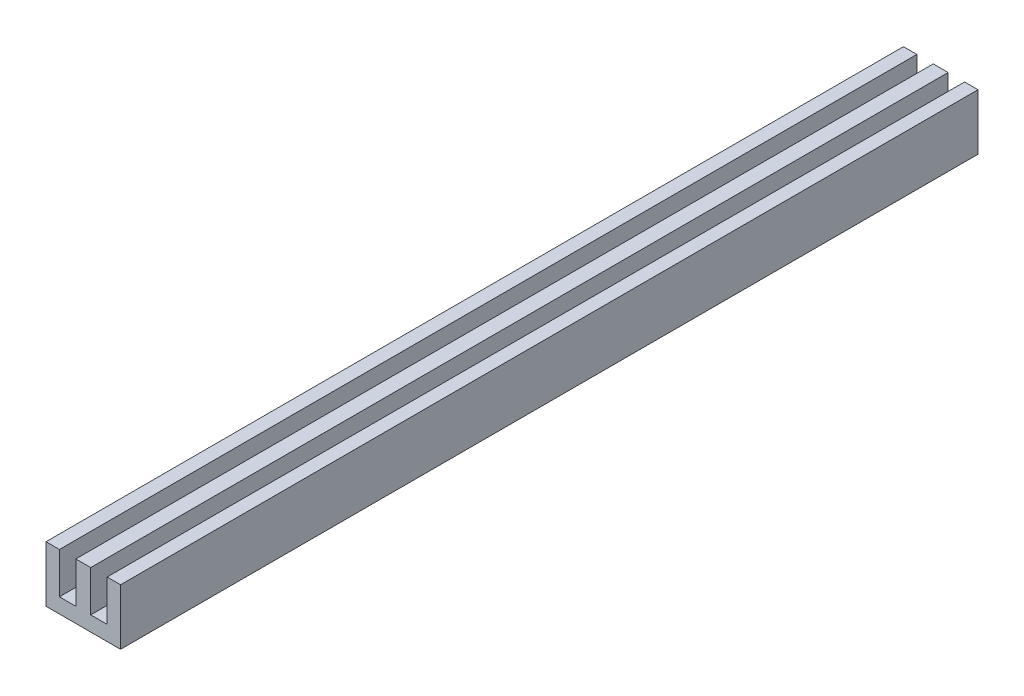
ISO-10303-21;
HEADER;
FILE_DESCRIPTION(('STEP AP214'),'2;1');
FILE_NAME('part.step','',(''),(''),'','','');
FILE_SCHEMA(('AUTOMOTIVE_DESIGN { 1 0 10303 214 1 1 1 1 }'));
ENDSEC;
DATA;
#1=APPLICATION_CONTEXT('core data for automotive mechanical design processes');
#2=APPLICATION_PROTOCOL_DEFINITION('international standard','automotive_design',2000,#1);
#3=PRODUCT_CONTEXT('',#1,'mechanical');
#4=PRODUCT('Part','Part','',(#3));
#5=PRODUCT_RELATED_PRODUCT_CATEGORY('part','',(#4));
#6=PRODUCT_DEFINITION_FORMATION('','',#4);
#7=PRODUCT_DEFINITION_CONTEXT('part definition',#1,'design');
#8=PRODUCT_DEFINITION('design','',#6,#7);
#9=PRODUCT_DEFINITION_SHAPE('','',#8);
#10=(LENGTH_UNIT() NAMED_UNIT(*) SI_UNIT(.MILLI.,.METRE.));
#11=(NAMED_UNIT(*) PLANE_ANGLE_UNIT() SI_UNIT($,.RADIAN.));
#12=(NAMED_UNIT(*) SI_UNIT($,.STERADIAN.) SOLID_ANGLE_UNIT());
#13=UNCERTAINTY_MEASURE_WITH_UNIT(LENGTH_MEASURE(1.E-05),#10,'distance_accuracy_value','');
#14=(GEOMETRIC_REPRESENTATION_CONTEXT(3) GLOBAL_UNCERTAINTY_ASSIGNED_CONTEXT((#13)) GLOBAL_UNIT_ASSIGNED_CONTEXT((#10,
#11,#12)) REPRESENTATION_CONTEXT('',''));
#15=CARTESIAN_POINT('',(0.,0.,0.));
#16=DIRECTION('',(0.,0.,1.));
#17=DIRECTION('',(1.,0.,0.));
#18=AXIS2_PLACEMENT_3D('',#15,#16,#17);
#19=CARTESIAN_POINT('',(0.,4.,115.));
#20=DIRECTION('',(0.,-1.,0.));
#21=DIRECTION('',(0.,0.,-1.));
#22=AXIS2_PLACEMENT_3D('',#19,#20,#21);
#23=PLANE('',#22);
#24=DIRECTION('',(-1.,0.,0.));
#25=VECTOR('',#24,1.);
#26=CARTESIAN_POINT('',(0.,4.,0.));
#27=LINE('',#26,#25);
#28=CARTESIAN_POINT('',(-3.,4.,0.));
#29=VERTEX_POINT('',#28);
#30=CARTESIAN_POINT('',(-5.,4.,0.));
#31=VERTEX_POINT('',#30);
#32=EDGE_CURVE('E159',#29,#31,#27,.T.);
#33=ORIENTED_EDGE('',*,*,#32,.T.);
#34=DIRECTION('',(0.,0.,-1.));
#35=VECTOR('',#34,1.);
#36=CARTESIAN_POINT('',(-5.,4.,115.));
#37=LINE('',#36,#35);
#38=CARTESIAN_POINT('',(-5.,4.,115.));
#39=VERTEX_POINT('',#38);
#40=EDGE_CURVE('E11',#39,#31,#37,.T.);
#41=ORIENTED_EDGE('',*,*,#40,.F.);
#42=DIRECTION('',(-1.,0.,0.));
#43=VECTOR('',#42,1.);
#44=CARTESIAN_POINT('',(0.,4.,115.));
#45=LINE('',#44,#43);
#46=CARTESIAN_POINT('',(-3.,4.,115.));
#47=VERTEX_POINT('',#46);
#48=EDGE_CURVE('E185',#47,#39,#45,.T.);
#49=ORIENTED_EDGE('',*,*,#48,.F.);
#50=DIRECTION('',(0.,0.,-1.));
#51=VECTOR('',#50,1.);
#52=CARTESIAN_POINT('',(-3.,4.,115.));
#53=LINE('',#52,#51);
#54=EDGE_CURVE('E51',#47,#29,#53,.T.);
#55=ORIENTED_EDGE('',*,*,#54,.T.);
#56=EDGE_LOOP('',(#33,#41,#49,#55));
#57=FACE_BOUND('',#56,.T.);
#58=ADVANCED_FACE('F35',(#57),#23,.F.);
#59=CARTESIAN_POINT('',(-5.,0.,115.));
#60=DIRECTION('',(1.,0.,0.));
#61=DIRECTION('',(0.,1.,0.));
#62=AXIS2_PLACEMENT_3D('',#59,#60,#61);
#63=PLANE('',#62);
#64=DIRECTION('',(0.,-1.,0.));
#65=VECTOR('',#64,1.);
#66=CARTESIAN_POINT('',(-5.,0.,0.));
#67=LINE('',#66,#65);
#68=CARTESIAN_POINT('',(-5.,-1.5,0.));
#69=VERTEX_POINT('',#68);
#70=EDGE_CURVE('E161',#31,#69,#67,.T.);
#71=ORIENTED_EDGE('',*,*,#70,.T.);
#72=DIRECTION('',(0.,0.,-1.));
#73=VECTOR('',#72,1.);
#74=CARTESIAN_POINT('',(-5.,-1.5,115.));
#75=LINE('',#74,#73);
#76=CARTESIAN_POINT('',(-5.,-1.5,115.));
#77=VERTEX_POINT('',#76);
#78=EDGE_CURVE('E43',#77,#69,#75,.T.);
#79=ORIENTED_EDGE('',*,*,#78,.F.);
#80=DIRECTION('',(0.,-1.,0.));
#81=VECTOR('',#80,1.);
#82=CARTESIAN_POINT('',(-5.,0.,115.));
#83=LINE('',#82,#81);
#84=EDGE_CURVE('E102',#39,#77,#83,.T.);
#85=ORIENTED_EDGE('',*,*,#84,.F.);
#86=ORIENTED_EDGE('',*,*,#40,.T.);
#87=EDGE_LOOP('',(#71,#79,#85,#86));
#88=FACE_BOUND('',#87,.T.);
#89=ADVANCED_FACE('F252',(#88),#63,.F.);
#90=CARTESIAN_POINT('',(0.,-1.5,115.));
#91=DIRECTION('',(0.,-1.,0.));
#92=DIRECTION('',(0.,0.,-1.));
#93=AXIS2_PLACEMENT_3D('',#90,#91,#92);
#94=PLANE('',#93);
#95=DIRECTION('',(-1.,0.,0.));
#96=VECTOR('',#95,1.);
#97=CARTESIAN_POINT('',(0.,-1.5,0.));
#98=LINE('',#97,#96);
#99=CARTESIAN_POINT('',(-7.2,-1.5,0.));
#100=VERTEX_POINT('',#99);
#101=EDGE_CURVE('E163',#69,#100,#98,.T.);
#102=ORIENTED_EDGE('',*,*,#101,.T.);
#103=DIRECTION('',(0.,0.,-1.));
#104=VECTOR('',#103,1.);
#105=CARTESIAN_POINT('',(-7.2,-1.5,115.));
#106=LINE('',#105,#104);
#107=CARTESIAN_POINT('',(-7.2,-1.5,115.));
#108=VERTEX_POINT('',#107);
#109=EDGE_CURVE('E202',#108,#100,#106,.T.);
#110=ORIENTED_EDGE('',*,*,#109,.F.);
#111=DIRECTION('',(-1.,0.,0.));
#112=VECTOR('',#111,1.);
#113=CARTESIAN_POINT('',(0.,-1.5,115.));
#114=LINE('',#113,#112);
#115=EDGE_CURVE('E147',#77,#108,#114,.T.);
#116=ORIENTED_EDGE('',*,*,#115,.F.);
#117=ORIENTED_EDGE('',*,*,#78,.T.);
#118=EDGE_LOOP('',(#102,#110,#116,#117));
#119=FACE_BOUND('',#118,.T.);
#120=ADVANCED_FACE('F208',(#119),#94,.F.);
#121=CARTESIAN_POINT('',(-7.2,0.,115.));
#122=DIRECTION('',(-1.,0.,0.));
#123=DIRECTION('',(0.,0.,1.));
#124=AXIS2_PLACEMENT_3D('',#121,#122,#123);
#125=PLANE('',#124);
#126=DIRECTION('',(0.,1.,0.));
#127=VECTOR('',#126,1.);
#128=CARTESIAN_POINT('',(-7.2,0.,0.));
#129=LINE('',#128,#127);
#130=CARTESIAN_POINT('',(-7.2,4.,0.));
#131=VERTEX_POINT('',#130);
#132=EDGE_CURVE('E165',#100,#131,#129,.T.);
#133=ORIENTED_EDGE('',*,*,#132,.T.);
#134=DIRECTION('',(0.,0.,-1.));
#135=VECTOR('',#134,1.);
#136=CARTESIAN_POINT('',(-7.2,4.,115.));
#137=LINE('',#136,#135);
#138=CARTESIAN_POINT('',(-7.2,4.,115.));
#139=VERTEX_POINT('',#138);
#140=EDGE_CURVE('E199',#139,#131,#137,.T.);
#141=ORIENTED_EDGE('',*,*,#140,.F.);
#142=DIRECTION('',(0.,1.,0.));
#143=VECTOR('',#142,1.);
#144=CARTESIAN_POINT('',(-7.2,0.,115.));
#145=LINE('',#144,#143);
#146=EDGE_CURVE('E226',#108,#139,#145,.T.);
#147=ORIENTED_EDGE('',*,*,#146,.F.);
#148=ORIENTED_EDGE('',*,*,#109,.T.);
#149=EDGE_LOOP('',(#133,#141,#147,#148));
#150=FACE_BOUND('',#149,.T.);
#151=ADVANCED_FACE('F217',(#150),#125,.F.);
#152=CARTESIAN_POINT('',(0.,4.,115.));
#153=DIRECTION('',(0.,-1.,0.));
#154=DIRECTION('',(0.,0.,-1.));
#155=AXIS2_PLACEMENT_3D('',#152,#153,#154);
#156=PLANE('',#155);
#157=DIRECTION('',(-1.,0.,0.));
#158=VECTOR('',#157,1.);
#159=CARTESIAN_POINT('',(0.,4.,0.));
#160=LINE('',#159,#158);
#161=CARTESIAN_POINT('',(-9.,4.,0.));
#162=VERTEX_POINT('',#161);
#163=EDGE_CURVE('E168',#131,#162,#160,.T.);
#164=ORIENTED_EDGE('',*,*,#163,.T.);
#165=DIRECTION('',(0.,0.,-1.));
#166=VECTOR('',#165,1.);
#167=CARTESIAN_POINT('',(-9.,4.,115.));
#168=LINE('',#167,#166);
#169=CARTESIAN_POINT('',(-9.,4.,115.));
#170=VERTEX_POINT('',#169);
#171=EDGE_CURVE('E196',#170,#162,#168,.T.);
#172=ORIENTED_EDGE('',*,*,#171,.F.);
#173=DIRECTION('',(-1.,0.,0.));
#174=VECTOR('',#173,1.);
#175=CARTESIAN_POINT('',(0.,4.,115.));
#176=LINE('',#175,#174);
#177=EDGE_CURVE('E223',#139,#170,#176,.T.);
#178=ORIENTED_EDGE('',*,*,#177,.F.);
#179=ORIENTED_EDGE('',*,*,#140,.T.);
#180=EDGE_LOOP('',(#164,#172,#178,#179));
#181=FACE_BOUND('',#180,.T.);
#182=ADVANCED_FACE('F221',(#181),#156,.F.);
#183=CARTESIAN_POINT('',(-9.,0.,115.));
#184=DIRECTION('',(1.,0.,0.));
#185=DIRECTION('',(0.,1.,0.));
#186=AXIS2_PLACEMENT_3D('',#183,#184,#185);
#187=PLANE('',#186);
#188=DIRECTION('',(0.,-1.,0.));
#189=VECTOR('',#188,1.);
#190=CARTESIAN_POINT('',(-9.,0.,0.));
#191=LINE('',#190,#189);
#192=CARTESIAN_POINT('',(-9.,-3.5,0.));
#193=VERTEX_POINT('',#192);
#194=EDGE_CURVE('E170',#162,#193,#191,.T.);
#195=ORIENTED_EDGE('',*,*,#194,.T.);
#196=DIRECTION('',(0.,0.,-1.));
#197=VECTOR('',#196,1.);
#198=CARTESIAN_POINT('',(-9.,-3.5,115.));
#199=LINE('',#198,#197);
#200=CARTESIAN_POINT('',(-9.,-3.5,115.));
#201=VERTEX_POINT('',#200);
#202=EDGE_CURVE('E193',#201,#193,#199,.T.);
#203=ORIENTED_EDGE('',*,*,#202,.F.);
#204=DIRECTION('',(0.,-1.,0.));
#205=VECTOR('',#204,1.);
#206=CARTESIAN_POINT('',(-9.,0.,115.));
#207=LINE('',#206,#205);
#208=EDGE_CURVE('E225',#170,#201,#207,.T.);
#209=ORIENTED_EDGE('',*,*,#208,.F.);
#210=ORIENTED_EDGE('',*,*,#171,.T.);
#211=EDGE_LOOP('',(#195,#203,#209,#210));
#212=FACE_BOUND('',#211,.T.);
#213=ADVANCED_FACE('F267',(#212),#187,.F.);
#214=CARTESIAN_POINT('',(0.,-3.5,115.));
#215=DIRECTION('',(0.,1.,0.));
#216=DIRECTION('',(0.,0.,1.));
#217=AXIS2_PLACEMENT_3D('',#214,#215,#216);
#218=PLANE('',#217);
#219=DIRECTION('',(1.,0.,0.));
#220=VECTOR('',#219,1.);
#221=CARTESIAN_POINT('',(0.,-3.5,0.));
#222=LINE('',#221,#220);
#223=CARTESIAN_POINT('',(0.999999999999999,-3.5,0.));
#224=VERTEX_POINT('',#223);
#225=EDGE_CURVE('E172',#193,#224,#222,.T.);
#226=ORIENTED_EDGE('',*,*,#225,.T.);
#227=DIRECTION('',(0.,0.,-1.));
#228=VECTOR('',#227,1.);
#229=CARTESIAN_POINT('',(0.999999999999999,-3.5,115.));
#230=LINE('',#229,#228);
#231=CARTESIAN_POINT('',(0.999999999999999,-3.5,115.));
#232=VERTEX_POINT('',#231);
#233=EDGE_CURVE('E191',#232,#224,#230,.T.);
#234=ORIENTED_EDGE('',*,*,#233,.F.);
#235=DIRECTION('',(1.,0.,0.));
#236=VECTOR('',#235,1.);
#237=CARTESIAN_POINT('',(0.,-3.5,115.));
#238=LINE('',#237,#236);
#239=EDGE_CURVE('E228',#201,#232,#238,.T.);
#240=ORIENTED_EDGE('',*,*,#239,.F.);
#241=ORIENTED_EDGE('',*,*,#202,.T.);
#242=EDGE_LOOP('',(#226,#234,#240,#241));
#243=FACE_BOUND('',#242,.T.);
#244=ADVANCED_FACE('F270',(#243),#218,.F.);
#245=CARTESIAN_POINT('',(0.999999999999999,0.,115.));
#246=DIRECTION('',(1.,0.,0.));
#247=DIRECTION('',(0.,0.,-1.));
#248=AXIS2_PLACEMENT_3D('',#245,#246,#247);
#249=PLANE('',#248);
#250=DIRECTION('',(0.,-1.,0.));
#251=VECTOR('',#250,1.);
#252=CARTESIAN_POINT('',(0.999999999999999,0.,0.));
#253=LINE('',#252,#251);
#254=CARTESIAN_POINT('',(0.999999999999999,4.,0.));
#255=VERTEX_POINT('',#254);
#256=EDGE_CURVE('E175',#255,#224,#253,.T.);
#257=ORIENTED_EDGE('',*,*,#256,.F.);
#258=DIRECTION('',(0.,0.,-1.));
#259=VECTOR('',#258,1.);
#260=CARTESIAN_POINT('',(0.999999999999999,4.,115.));
#261=LINE('',#260,#259);
#262=CARTESIAN_POINT('',(0.999999999999999,4.,115.));
#263=VERTEX_POINT('',#262);
#264=EDGE_CURVE('E189',#263,#255,#261,.T.);
#265=ORIENTED_EDGE('',*,*,#264,.F.);
#266=DIRECTION('',(0.,-1.,0.));
#267=VECTOR('',#266,1.);
#268=CARTESIAN_POINT('',(0.999999999999999,0.,115.));
#269=LINE('',#268,#267);
#270=EDGE_CURVE('E154',#263,#232,#269,.T.);
#271=ORIENTED_EDGE('',*,*,#270,.T.);
#272=ORIENTED_EDGE('',*,*,#233,.T.);
#273=EDGE_LOOP('',(#257,#265,#271,#272));
#274=FACE_BOUND('',#273,.T.);
#275=ADVANCED_FACE('F235',(#274),#249,.T.);
#276=CARTESIAN_POINT('',(0.,4.,115.));
#277=DIRECTION('',(0.,1.,0.));
#278=DIRECTION('',(0.,0.,1.));
#279=AXIS2_PLACEMENT_3D('',#276,#277,#278);
#280=PLANE('',#279);
#281=DIRECTION('',(1.,0.,0.));
#282=VECTOR('',#281,1.);
#283=CARTESIAN_POINT('',(0.,4.,0.));
#284=LINE('',#283,#282);
#285=CARTESIAN_POINT('',(-0.799999999999997,4.,0.));
#286=VERTEX_POINT('',#285);
#287=EDGE_CURVE('E178',#286,#255,#284,.T.);
#288=ORIENTED_EDGE('',*,*,#287,.F.);
#289=DIRECTION('',(0.,0.,-1.));
#290=VECTOR('',#289,1.);
#291=CARTESIAN_POINT('',(-0.799999999999997,4.,115.));
#292=LINE('',#291,#290);
#293=CARTESIAN_POINT('',(-0.799999999999997,4.,115.));
#294=VERTEX_POINT('',#293);
#295=EDGE_CURVE('E139',#294,#286,#292,.T.);
#296=ORIENTED_EDGE('',*,*,#295,.F.);
#297=DIRECTION('',(1.,0.,0.));
#298=VECTOR('',#297,1.);
#299=CARTESIAN_POINT('',(0.,4.,115.));
#300=LINE('',#299,#298);
#301=EDGE_CURVE('E152',#294,#263,#300,.T.);
#302=ORIENTED_EDGE('',*,*,#301,.T.);
#303=ORIENTED_EDGE('',*,*,#264,.T.);
#304=EDGE_LOOP('',(#288,#296,#302,#303));
#305=FACE_BOUND('',#304,.T.);
#306=ADVANCED_FACE('F240',(#305),#280,.T.);
#307=CARTESIAN_POINT('',(-0.799999999999998,0.,115.));
#308=DIRECTION('',(-1.,0.,0.));
#309=DIRECTION('',(0.,-1.,0.));
#310=AXIS2_PLACEMENT_3D('',#307,#308,#309);
#311=PLANE('',#310);
#312=DIRECTION('',(0.,1.,0.));
#313=VECTOR('',#312,1.);
#314=CARTESIAN_POINT('',(-0.799999999999998,0.,0.));
#315=LINE('',#314,#313);
#316=CARTESIAN_POINT('',(-0.799999999999999,-1.5,0.));
#317=VERTEX_POINT('',#316);
#318=EDGE_CURVE('E136',#317,#286,#315,.T.);
#319=ORIENTED_EDGE('',*,*,#318,.F.);
#320=DIRECTION('',(0.,0.,-1.));
#321=VECTOR('',#320,1.);
#322=CARTESIAN_POINT('',(-0.799999999999999,-1.5,115.));
#323=LINE('',#322,#321);
#324=CARTESIAN_POINT('',(-0.799999999999999,-1.5,115.));
#325=VERTEX_POINT('',#324);
#326=EDGE_CURVE('E130',#325,#317,#323,.T.);
#327=ORIENTED_EDGE('',*,*,#326,.F.);
#328=DIRECTION('',(0.,1.,0.));
#329=VECTOR('',#328,1.);
#330=CARTESIAN_POINT('',(-0.799999999999998,0.,115.));
#331=LINE('',#330,#329);
#332=EDGE_CURVE('E134',#325,#294,#331,.T.);
#333=ORIENTED_EDGE('',*,*,#332,.T.);
#334=ORIENTED_EDGE('',*,*,#295,.T.);
#335=EDGE_LOOP('',(#319,#327,#333,#334));
#336=FACE_BOUND('',#335,.T.);
#337=ADVANCED_FACE('F132',(#336),#311,.T.);
#338=CARTESIAN_POINT('',(-3.,-1.5,0.));
#339=VERTEX_POINT('',#338);
#340=EDGE_CURVE('E166',#317,#339,#98,.T.);
#341=ORIENTED_EDGE('',*,*,#340,.T.);
#342=DIRECTION('',(0.,0.,-1.));
#343=VECTOR('',#342,1.);
#344=CARTESIAN_POINT('',(-3.,-1.5,115.));
#345=LINE('',#344,#343);
#346=CARTESIAN_POINT('',(-3.,-1.5,115.));
#347=VERTEX_POINT('',#346);
#348=EDGE_CURVE('E90',#347,#339,#345,.T.);
#349=ORIENTED_EDGE('',*,*,#348,.F.);
#350=EDGE_CURVE('E141',#325,#347,#114,.T.);
#351=ORIENTED_EDGE('',*,*,#350,.F.);
#352=ORIENTED_EDGE('',*,*,#326,.T.);
#353=EDGE_LOOP('',(#341,#349,#351,#352));
#354=FACE_BOUND('',#353,.T.);
#355=ADVANCED_FACE('F142',(#354),#94,.F.);
#356=CARTESIAN_POINT('',(-3.,0.,115.));
#357=DIRECTION('',(1.,0.,0.));
#358=DIRECTION('',(0.,1.,0.));
#359=AXIS2_PLACEMENT_3D('',#356,#357,#358);
#360=PLANE('',#359);
#361=DIRECTION('',(0.,-1.,0.));
#362=VECTOR('',#361,1.);
#363=CARTESIAN_POINT('',(-3.,0.,0.));
#364=LINE('',#363,#362);
#365=EDGE_CURVE('E182',#29,#339,#364,.T.);
#366=ORIENTED_EDGE('',*,*,#365,.F.);
#367=ORIENTED_EDGE('',*,*,#54,.F.);
#368=DIRECTION('',(0.,-1.,0.));
#369=VECTOR('',#368,1.);
#370=CARTESIAN_POINT('',(-3.,0.,115.));
#371=LINE('',#370,#369);
#372=EDGE_CURVE('E145',#47,#347,#371,.T.);
#373=ORIENTED_EDGE('',*,*,#372,.T.);
#374=ORIENTED_EDGE('',*,*,#348,.T.);
#375=EDGE_LOOP('',(#366,#367,#373,#374));
#376=FACE_BOUND('',#375,.T.);
#377=ADVANCED_FACE('F241',(#376),#360,.T.);
#378=CARTESIAN_POINT('',(0.,0.,115.));
#379=DIRECTION('',(0.,0.,1.));
#380=DIRECTION('',(1.,0.,0.));
#381=AXIS2_PLACEMENT_3D('',#378,#379,#380);
#382=PLANE('',#381);
#383=ORIENTED_EDGE('',*,*,#48,.T.);
#384=ORIENTED_EDGE('',*,*,#84,.T.);
#385=ORIENTED_EDGE('',*,*,#115,.T.);
#386=ORIENTED_EDGE('',*,*,#146,.T.);
#387=ORIENTED_EDGE('',*,*,#177,.T.);
#388=ORIENTED_EDGE('',*,*,#208,.T.);
#389=ORIENTED_EDGE('',*,*,#239,.T.);
#390=ORIENTED_EDGE('',*,*,#270,.F.);
#391=ORIENTED_EDGE('',*,*,#301,.F.);
#392=ORIENTED_EDGE('',*,*,#332,.F.);
#393=ORIENTED_EDGE('',*,*,#350,.T.);
#394=ORIENTED_EDGE('',*,*,#372,.F.);
#395=EDGE_LOOP('',(#383,#384,#385,#386,#387,#388,#389,#390,#391,#392,#393,#394));
#396=FACE_BOUND('',#395,.T.);
#397=ADVANCED_FACE('F149',(#396),#382,.T.);
#398=CARTESIAN_POINT('',(0.,0.,0.));
#399=DIRECTION('',(0.,0.,1.));
#400=DIRECTION('',(1.,0.,0.));
#401=AXIS2_PLACEMENT_3D('',#398,#399,#400);
#402=PLANE('',#401);
#403=ORIENTED_EDGE('',*,*,#32,.F.);
#404=ORIENTED_EDGE('',*,*,#365,.T.);
#405=ORIENTED_EDGE('',*,*,#340,.F.);
#406=ORIENTED_EDGE('',*,*,#318,.T.);
#407=ORIENTED_EDGE('',*,*,#287,.T.);
#408=ORIENTED_EDGE('',*,*,#256,.T.);
#409=ORIENTED_EDGE('',*,*,#225,.F.);
#410=ORIENTED_EDGE('',*,*,#194,.F.);
#411=ORIENTED_EDGE('',*,*,#163,.F.);
#412=ORIENTED_EDGE('',*,*,#132,.F.);
#413=ORIENTED_EDGE('',*,*,#101,.F.);
#414=ORIENTED_EDGE('',*,*,#70,.F.);
#415=EDGE_LOOP('',(#403,#404,#405,#406,#407,#408,#409,#410,#411,#412,#413,#414));
#416=FACE_BOUND('',#415,.T.);
#417=ADVANCED_FACE('F212',(#416),#402,.F.);
#418=CLOSED_SHELL('',(#58,#89,#120,#151,#182,#213,#244,#275,#306,#337,#355,#377,#397,#417));
#419=MANIFOLD_SOLID_BREP('B2',#418);
#420=ADVANCED_BREP_SHAPE_REPRESENTATION('',(#18,#419),#14);
#421=SHAPE_DEFINITION_REPRESENTATION(#9,#420);
ENDSEC;
END-ISO-10303-21;
